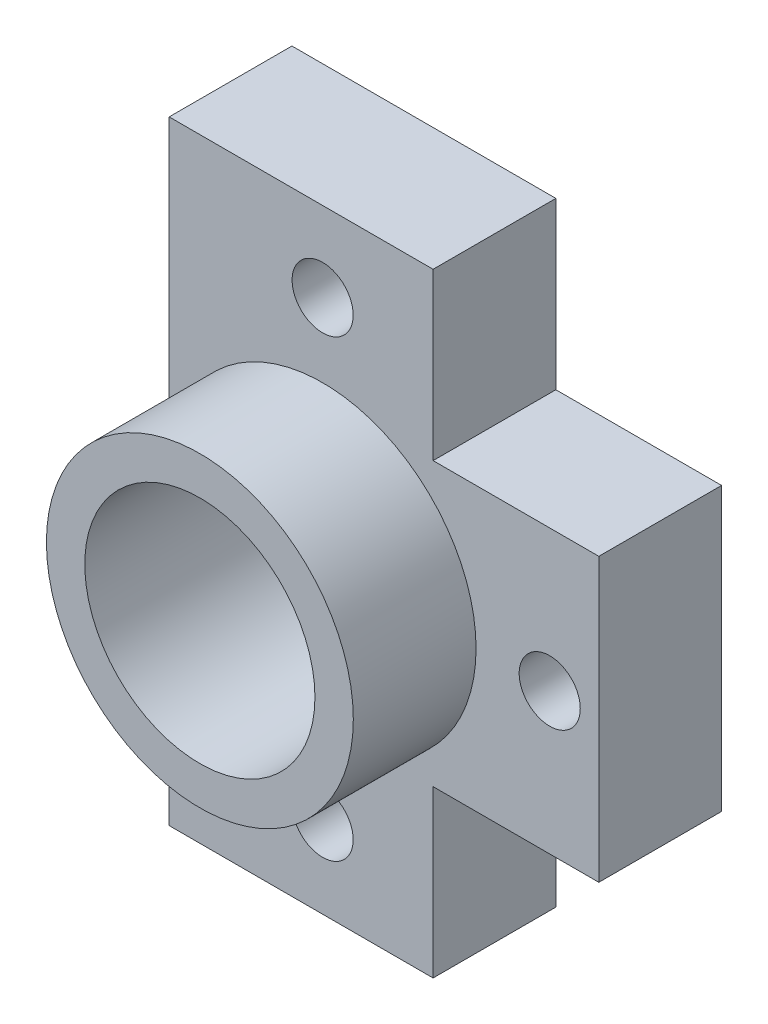
ISO-10303-21;
HEADER;
FILE_DESCRIPTION(('STEP AP214'),'2;1');
FILE_NAME('part.step','',(''),(''),'','','');
FILE_SCHEMA(('AUTOMOTIVE_DESIGN { 1 0 10303 214 1 1 1 1 }'));
ENDSEC;
DATA;
#1=APPLICATION_CONTEXT('core data for automotive mechanical design processes');
#2=APPLICATION_PROTOCOL_DEFINITION('international standard','automotive_design',2000,#1);
#3=PRODUCT_CONTEXT('',#1,'mechanical');
#4=PRODUCT('Part','Part','',(#3));
#5=PRODUCT_RELATED_PRODUCT_CATEGORY('part','',(#4));
#6=PRODUCT_DEFINITION_FORMATION('','',#4);
#7=PRODUCT_DEFINITION_CONTEXT('part definition',#1,'design');
#8=PRODUCT_DEFINITION('design','',#6,#7);
#9=PRODUCT_DEFINITION_SHAPE('','',#8);
#10=(LENGTH_UNIT() NAMED_UNIT(*) SI_UNIT(.MILLI.,.METRE.));
#11=(NAMED_UNIT(*) PLANE_ANGLE_UNIT() SI_UNIT($,.RADIAN.));
#12=(NAMED_UNIT(*) SI_UNIT($,.STERADIAN.) SOLID_ANGLE_UNIT());
#13=UNCERTAINTY_MEASURE_WITH_UNIT(LENGTH_MEASURE(1.E-05),#10,'distance_accuracy_value','');
#14=(GEOMETRIC_REPRESENTATION_CONTEXT(3) GLOBAL_UNCERTAINTY_ASSIGNED_CONTEXT((#13)) GLOBAL_UNIT_ASSIGNED_CONTEXT((#10,
#11,#12)) REPRESENTATION_CONTEXT('',''));
#15=CARTESIAN_POINT('',(0.,0.,0.));
#16=DIRECTION('',(0.,0.,1.));
#17=DIRECTION('',(1.,0.,0.));
#18=AXIS2_PLACEMENT_3D('',#15,#16,#17);
#19=CARTESIAN_POINT('',(8.89,-12.7,10.16));
#20=DIRECTION('',(-1.,0.,0.));
#21=DIRECTION('',(0.,0.,1.));
#22=AXIS2_PLACEMENT_3D('',#19,#20,#21);
#23=PLANE('',#22);
#24=DIRECTION('',(0.,1.,0.));
#25=VECTOR('',#24,1.);
#26=CARTESIAN_POINT('',(8.89,-12.7,5.08));
#27=LINE('',#26,#25);
#28=CARTESIAN_POINT('',(8.89,-5.842,5.08));
#29=VERTEX_POINT('',#28);
#30=CARTESIAN_POINT('',(8.89,5.842,5.08));
#31=VERTEX_POINT('',#30);
#32=EDGE_CURVE('E120',#29,#31,#27,.T.);
#33=ORIENTED_EDGE('',*,*,#32,.F.);
#34=DIRECTION('',(0.,0.,1.));
#35=VECTOR('',#34,1.);
#36=CARTESIAN_POINT('',(8.89,-5.842,0.));
#37=LINE('',#36,#35);
#38=CARTESIAN_POINT('',(8.89,-5.842,0.));
#39=VERTEX_POINT('',#38);
#40=EDGE_CURVE('E52',#39,#29,#37,.T.);
#41=ORIENTED_EDGE('',*,*,#40,.F.);
#42=DIRECTION('',(0.,1.,0.));
#43=VECTOR('',#42,1.);
#44=CARTESIAN_POINT('',(8.89,-12.7,0.));
#45=LINE('',#44,#43);
#46=CARTESIAN_POINT('',(8.89,5.842,0.));
#47=VERTEX_POINT('',#46);
#48=EDGE_CURVE('E118',#39,#47,#45,.T.);
#49=ORIENTED_EDGE('',*,*,#48,.T.);
#50=DIRECTION('',(0.,0.,1.));
#51=VECTOR('',#50,1.);
#52=CARTESIAN_POINT('',(8.89,5.842,0.));
#53=LINE('',#52,#51);
#54=EDGE_CURVE('E227',#47,#31,#53,.T.);
#55=ORIENTED_EDGE('',*,*,#54,.T.);
#56=EDGE_LOOP('',(#33,#41,#49,#55));
#57=FACE_BOUND('',#56,.T.);
#58=ADVANCED_FACE('F36',(#57),#23,.F.);
#59=CARTESIAN_POINT('',(-8.89,12.7,10.16));
#60=DIRECTION('',(0.,-1.,0.));
#61=DIRECTION('',(0.,0.,-1.));
#62=AXIS2_PLACEMENT_3D('',#59,#60,#61);
#63=PLANE('',#62);
#64=DIRECTION('',(-1.,0.,0.));
#65=VECTOR('',#64,1.);
#66=CARTESIAN_POINT('',(-8.89,12.7,5.08));
#67=LINE('',#66,#65);
#68=CARTESIAN_POINT('',(2.032,12.7,5.08));
#69=VERTEX_POINT('',#68);
#70=CARTESIAN_POINT('',(-8.89,12.7,5.08));
#71=VERTEX_POINT('',#70);
#72=EDGE_CURVE('E175',#69,#71,#67,.T.);
#73=ORIENTED_EDGE('',*,*,#72,.F.);
#74=DIRECTION('',(0.,0.,1.));
#75=VECTOR('',#74,1.);
#76=CARTESIAN_POINT('',(2.032,12.7,0.));
#77=LINE('',#76,#75);
#78=CARTESIAN_POINT('',(2.032,12.7,0.));
#79=VERTEX_POINT('',#78);
#80=EDGE_CURVE('E60',#79,#69,#77,.T.);
#81=ORIENTED_EDGE('',*,*,#80,.F.);
#82=DIRECTION('',(-1.,0.,0.));
#83=VECTOR('',#82,1.);
#84=CARTESIAN_POINT('',(-8.89,12.7,0.));
#85=LINE('',#84,#83);
#86=CARTESIAN_POINT('',(-8.89,12.7,0.));
#87=VERTEX_POINT('',#86);
#88=EDGE_CURVE('E128',#79,#87,#85,.T.);
#89=ORIENTED_EDGE('',*,*,#88,.T.);
#90=DIRECTION('',(0.,0.,-1.));
#91=VECTOR('',#90,1.);
#92=CARTESIAN_POINT('',(-8.89,12.7,10.16));
#93=LINE('',#92,#91);
#94=EDGE_CURVE('E44',#71,#87,#93,.T.);
#95=ORIENTED_EDGE('',*,*,#94,.F.);
#96=EDGE_LOOP('',(#73,#81,#89,#95));
#97=FACE_BOUND('',#96,.T.);
#98=ADVANCED_FACE('F236',(#97),#63,.F.);
#99=CARTESIAN_POINT('',(-8.89,-12.7,10.16));
#100=DIRECTION('',(1.,0.,0.));
#101=DIRECTION('',(0.,0.,-1.));
#102=AXIS2_PLACEMENT_3D('',#99,#100,#101);
#103=PLANE('',#102);
#104=DIRECTION('',(0.,-1.,0.));
#105=VECTOR('',#104,1.);
#106=CARTESIAN_POINT('',(-8.89,-12.7,5.08));
#107=LINE('',#106,#105);
#108=CARTESIAN_POINT('',(-8.88999999999999,0.,5.08));
#109=VERTEX_POINT('',#108);
#110=EDGE_CURVE('E174',#71,#109,#107,.T.);
#111=ORIENTED_EDGE('',*,*,#110,.F.);
#112=ORIENTED_EDGE('',*,*,#94,.T.);
#113=DIRECTION('',(0.,-1.,0.));
#114=VECTOR('',#113,1.);
#115=CARTESIAN_POINT('',(-8.89,-12.7,0.));
#116=LINE('',#115,#114);
#117=CARTESIAN_POINT('',(-8.89,-12.7,0.));
#118=VERTEX_POINT('',#117);
#119=EDGE_CURVE('E131',#87,#118,#116,.T.);
#120=ORIENTED_EDGE('',*,*,#119,.T.);
#121=DIRECTION('',(0.,0.,-1.));
#122=VECTOR('',#121,1.);
#123=CARTESIAN_POINT('',(-8.89,-12.7,10.16));
#124=LINE('',#123,#122);
#125=CARTESIAN_POINT('',(-8.89,-12.7,5.08));
#126=VERTEX_POINT('',#125);
#127=EDGE_CURVE('E143',#126,#118,#124,.T.);
#128=ORIENTED_EDGE('',*,*,#127,.F.);
#129=EDGE_CURVE('E170',#109,#126,#107,.T.);
#130=ORIENTED_EDGE('',*,*,#129,.F.);
#131=EDGE_LOOP('',(#111,#112,#120,#128,#130));
#132=FACE_BOUND('',#131,.T.);
#133=ADVANCED_FACE('F204',(#132),#103,.F.);
#134=CARTESIAN_POINT('',(-8.89,-12.7,10.16));
#135=DIRECTION('',(0.,1.,0.));
#136=DIRECTION('',(0.,0.,1.));
#137=AXIS2_PLACEMENT_3D('',#134,#135,#136);
#138=PLANE('',#137);
#139=DIRECTION('',(1.,0.,0.));
#140=VECTOR('',#139,1.);
#141=CARTESIAN_POINT('',(-8.89,-12.7,0.));
#142=LINE('',#141,#140);
#143=CARTESIAN_POINT('',(2.032,-12.7,0.));
#144=VERTEX_POINT('',#143);
#145=EDGE_CURVE('E140',#118,#144,#142,.T.);
#146=ORIENTED_EDGE('',*,*,#145,.T.);
#147=DIRECTION('',(0.,0.,1.));
#148=VECTOR('',#147,1.);
#149=CARTESIAN_POINT('',(2.032,-12.7,0.));
#150=LINE('',#149,#148);
#151=CARTESIAN_POINT('',(2.032,-12.7,5.08));
#152=VERTEX_POINT('',#151);
#153=EDGE_CURVE('E210',#144,#152,#150,.T.);
#154=ORIENTED_EDGE('',*,*,#153,.T.);
#155=DIRECTION('',(1.,0.,0.));
#156=VECTOR('',#155,1.);
#157=CARTESIAN_POINT('',(-8.89,-12.7,5.08));
#158=LINE('',#157,#156);
#159=EDGE_CURVE('E12',#126,#152,#158,.T.);
#160=ORIENTED_EDGE('',*,*,#159,.F.);
#161=ORIENTED_EDGE('',*,*,#127,.T.);
#162=EDGE_LOOP('',(#146,#154,#160,#161));
#163=FACE_BOUND('',#162,.T.);
#164=ADVANCED_FACE('F185',(#163),#138,.F.);
#165=CARTESIAN_POINT('',(8.89,12.7,10.16));
#166=DIRECTION('',(0.,0.,-1.));
#167=DIRECTION('',(-1.,0.,0.));
#168=AXIS2_PLACEMENT_3D('',#165,#166,#167);
#169=PLANE('',#168);
#170=CARTESIAN_POINT('',(-2.53999999999999,0.,10.16));
#171=DIRECTION('',(0.,0.,1.));
#172=DIRECTION('',(1.,0.,0.));
#173=AXIS2_PLACEMENT_3D('',#170,#171,#172);
#174=CIRCLE('',#173,4.7625);
#175=CARTESIAN_POINT('',(2.22250000000001,0.,10.16));
#176=VERTEX_POINT('',#175);
#177=EDGE_CURVE('E134',#176,#176,#174,.T.);
#178=ORIENTED_EDGE('',*,*,#177,.F.);
#179=EDGE_LOOP('',(#178));
#180=FACE_BOUND('',#179,.T.);
#181=CARTESIAN_POINT('',(-2.53999999999999,0.,10.16));
#182=DIRECTION('',(0.,0.,1.));
#183=DIRECTION('',(1.,0.,0.));
#184=AXIS2_PLACEMENT_3D('',#181,#182,#183);
#185=CIRCLE('',#184,6.35);
#186=CARTESIAN_POINT('',(3.81000000000001,0.,10.16));
#187=VERTEX_POINT('',#186);
#188=EDGE_CURVE('E166',#187,#187,#185,.T.);
#189=ORIENTED_EDGE('',*,*,#188,.T.);
#190=EDGE_LOOP('',(#189));
#191=FACE_BOUND('',#190,.T.);
#192=ADVANCED_FACE('F182',(#180,#191),#169,.F.);
#193=CARTESIAN_POINT('',(8.89,12.7,0.));
#194=DIRECTION('',(0.,0.,-1.));
#195=DIRECTION('',(-1.,0.,0.));
#196=AXIS2_PLACEMENT_3D('',#193,#194,#195);
#197=PLANE('',#196);
#198=DIRECTION('',(0.,-1.,0.));
#199=VECTOR('',#198,1.);
#200=CARTESIAN_POINT('',(2.032,-12.7,0.));
#201=LINE('',#200,#199);
#202=CARTESIAN_POINT('',(2.032,-5.842,0.));
#203=VERTEX_POINT('',#202);
#204=EDGE_CURVE('E112',#203,#144,#201,.T.);
#205=ORIENTED_EDGE('',*,*,#204,.T.);
#206=ORIENTED_EDGE('',*,*,#145,.F.);
#207=ORIENTED_EDGE('',*,*,#119,.F.);
#208=ORIENTED_EDGE('',*,*,#88,.F.);
#209=DIRECTION('',(0.,-1.,0.));
#210=VECTOR('',#209,1.);
#211=CARTESIAN_POINT('',(2.032,12.7,0.));
#212=LINE('',#211,#210);
#213=CARTESIAN_POINT('',(2.032,5.842,0.));
#214=VERTEX_POINT('',#213);
#215=EDGE_CURVE('E220',#79,#214,#212,.T.);
#216=ORIENTED_EDGE('',*,*,#215,.T.);
#217=DIRECTION('',(1.,0.,0.));
#218=VECTOR('',#217,1.);
#219=CARTESIAN_POINT('',(8.89,5.842,0.));
#220=LINE('',#219,#218);
#221=EDGE_CURVE('E127',#214,#47,#220,.T.);
#222=ORIENTED_EDGE('',*,*,#221,.T.);
#223=ORIENTED_EDGE('',*,*,#48,.F.);
#224=DIRECTION('',(-1.,0.,0.));
#225=VECTOR('',#224,1.);
#226=CARTESIAN_POINT('',(8.89,-5.842,0.));
#227=LINE('',#226,#225);
#228=EDGE_CURVE('E105',#39,#203,#227,.T.);
#229=ORIENTED_EDGE('',*,*,#228,.T.);
#230=EDGE_LOOP('',(#205,#206,#207,#208,#216,#222,#223,#229));
#231=FACE_BOUND('',#230,.T.);
#232=CARTESIAN_POINT('',(6.85800000000001,0.,0.));
#233=DIRECTION('',(0.,0.,1.));
#234=DIRECTION('',(1.,0.,0.));
#235=AXIS2_PLACEMENT_3D('',#232,#233,#234);
#236=CIRCLE('',#235,1.26365);
#237=CARTESIAN_POINT('',(8.12165000000001,0.,0.));
#238=VERTEX_POINT('',#237);
#239=EDGE_CURVE('E160',#238,#238,#236,.T.);
#240=ORIENTED_EDGE('',*,*,#239,.T.);
#241=EDGE_LOOP('',(#240));
#242=FACE_BOUND('',#241,.T.);
#243=CARTESIAN_POINT('',(-2.53999999999999,-9.398,0.));
#244=DIRECTION('',(0.,0.,1.));
#245=DIRECTION('',(1.,0.,0.));
#246=AXIS2_PLACEMENT_3D('',#243,#244,#245);
#247=CIRCLE('',#246,1.26365);
#248=CARTESIAN_POINT('',(-1.27634999999999,-9.398,0.));
#249=VERTEX_POINT('',#248);
#250=EDGE_CURVE('E149',#249,#249,#247,.T.);
#251=ORIENTED_EDGE('',*,*,#250,.T.);
#252=EDGE_LOOP('',(#251));
#253=FACE_BOUND('',#252,.T.);
#254=CARTESIAN_POINT('',(-2.53999999999999,9.398,0.));
#255=DIRECTION('',(0.,0.,1.));
#256=DIRECTION('',(1.,0.,0.));
#257=AXIS2_PLACEMENT_3D('',#254,#255,#256);
#258=CIRCLE('',#257,1.26365);
#259=CARTESIAN_POINT('',(-1.27634999999999,9.398,0.));
#260=VERTEX_POINT('',#259);
#261=EDGE_CURVE('E148',#260,#260,#258,.T.);
#262=ORIENTED_EDGE('',*,*,#261,.T.);
#263=EDGE_LOOP('',(#262));
#264=FACE_BOUND('',#263,.T.);
#265=CARTESIAN_POINT('',(-2.53999999999999,0.,0.));
#266=DIRECTION('',(0.,0.,-1.));
#267=DIRECTION('',(-1.,0.,0.));
#268=AXIS2_PLACEMENT_3D('',#265,#266,#267);
#269=CIRCLE('',#268,4.7625);
#270=CARTESIAN_POINT('',(-7.30249999999999,0.,0.));
#271=VERTEX_POINT('',#270);
#272=EDGE_CURVE('E129',#271,#271,#269,.T.);
#273=ORIENTED_EDGE('',*,*,#272,.F.);
#274=EDGE_LOOP('',(#273));
#275=FACE_BOUND('',#274,.T.);
#276=ADVANCED_FACE('F123',(#231,#242,#253,#264,#275),#197,.T.);
#277=CARTESIAN_POINT('',(-2.53999999999999,0.,10.16));
#278=DIRECTION('',(0.,0.,1.));
#279=DIRECTION('',(1.,0.,0.));
#280=AXIS2_PLACEMENT_3D('',#277,#278,#279);
#281=CYLINDRICAL_SURFACE('',#280,4.7625);
#282=ORIENTED_EDGE('',*,*,#272,.T.);
#283=EDGE_LOOP('',(#282));
#284=FACE_BOUND('',#283,.T.);
#285=ORIENTED_EDGE('',*,*,#177,.T.);
#286=EDGE_LOOP('',(#285));
#287=FACE_BOUND('',#286,.T.);
#288=ADVANCED_FACE('F180',(#284,#287),#281,.F.);
#289=CARTESIAN_POINT('',(0.,0.,5.08));
#290=DIRECTION('',(0.,0.,1.));
#291=DIRECTION('',(1.,0.,0.));
#292=AXIS2_PLACEMENT_3D('',#289,#290,#291);
#293=PLANE('',#292);
#294=DIRECTION('',(0.,-1.,0.));
#295=VECTOR('',#294,1.);
#296=CARTESIAN_POINT('',(2.032,-12.7,5.08));
#297=LINE('',#296,#295);
#298=CARTESIAN_POINT('',(2.032,-5.842,5.08));
#299=VERTEX_POINT('',#298);
#300=EDGE_CURVE('E113',#299,#152,#297,.T.);
#301=ORIENTED_EDGE('',*,*,#300,.F.);
#302=DIRECTION('',(-1.,0.,0.));
#303=VECTOR('',#302,1.);
#304=CARTESIAN_POINT('',(8.89,-5.842,5.08));
#305=LINE('',#304,#303);
#306=EDGE_CURVE('E211',#29,#299,#305,.T.);
#307=ORIENTED_EDGE('',*,*,#306,.F.);
#308=ORIENTED_EDGE('',*,*,#32,.T.);
#309=DIRECTION('',(1.,0.,0.));
#310=VECTOR('',#309,1.);
#311=CARTESIAN_POINT('',(8.89,5.842,5.08));
#312=LINE('',#311,#310);
#313=CARTESIAN_POINT('',(2.032,5.842,5.08));
#314=VERTEX_POINT('',#313);
#315=EDGE_CURVE('E222',#314,#31,#312,.T.);
#316=ORIENTED_EDGE('',*,*,#315,.F.);
#317=DIRECTION('',(0.,-1.,0.));
#318=VECTOR('',#317,1.);
#319=CARTESIAN_POINT('',(2.032,12.7,5.08));
#320=LINE('',#319,#318);
#321=EDGE_CURVE('E218',#69,#314,#320,.T.);
#322=ORIENTED_EDGE('',*,*,#321,.F.);
#323=ORIENTED_EDGE('',*,*,#72,.T.);
#324=ORIENTED_EDGE('',*,*,#110,.T.);
#325=CARTESIAN_POINT('',(-2.53999999999999,0.,5.08));
#326=DIRECTION('',(0.,0.,1.));
#327=DIRECTION('',(1.,0.,0.));
#328=AXIS2_PLACEMENT_3D('',#325,#326,#327);
#329=CIRCLE('',#328,6.35);
#330=EDGE_CURVE('E167',#109,#109,#329,.T.);
#331=ORIENTED_EDGE('',*,*,#330,.F.);
#332=ORIENTED_EDGE('',*,*,#129,.T.);
#333=ORIENTED_EDGE('',*,*,#159,.T.);
#334=EDGE_LOOP('',(#301,#307,#308,#316,#322,#323,#324,#331,#332,#333));
#335=FACE_BOUND('',#334,.T.);
#336=CARTESIAN_POINT('',(6.85800000000001,0.,5.08));
#337=DIRECTION('',(0.,0.,1.));
#338=DIRECTION('',(1.,0.,0.));
#339=AXIS2_PLACEMENT_3D('',#336,#337,#338);
#340=CIRCLE('',#339,1.26364999999999);
#341=CARTESIAN_POINT('',(8.12165,0.,5.08));
#342=VERTEX_POINT('',#341);
#343=EDGE_CURVE('E39',#342,#342,#340,.T.);
#344=ORIENTED_EDGE('',*,*,#343,.F.);
#345=EDGE_LOOP('',(#344));
#346=FACE_BOUND('',#345,.T.);
#347=CARTESIAN_POINT('',(-2.53999999999999,-9.398,5.08));
#348=DIRECTION('',(0.,0.,1.));
#349=DIRECTION('',(1.,0.,0.));
#350=AXIS2_PLACEMENT_3D('',#347,#348,#349);
#351=CIRCLE('',#350,1.26364999999999);
#352=CARTESIAN_POINT('',(-1.27635,-9.398,5.08));
#353=VERTEX_POINT('',#352);
#354=EDGE_CURVE('E146',#353,#353,#351,.T.);
#355=ORIENTED_EDGE('',*,*,#354,.F.);
#356=EDGE_LOOP('',(#355));
#357=FACE_BOUND('',#356,.T.);
#358=CARTESIAN_POINT('',(-2.53999999999999,9.398,5.08));
#359=DIRECTION('',(0.,0.,1.));
#360=DIRECTION('',(1.,0.,0.));
#361=AXIS2_PLACEMENT_3D('',#358,#359,#360);
#362=CIRCLE('',#361,1.26364999999999);
#363=CARTESIAN_POINT('',(-1.27635,9.398,5.08));
#364=VERTEX_POINT('',#363);
#365=EDGE_CURVE('E153',#364,#364,#362,.T.);
#366=ORIENTED_EDGE('',*,*,#365,.F.);
#367=EDGE_LOOP('',(#366));
#368=FACE_BOUND('',#367,.T.);
#369=ADVANCED_FACE('F193',(#335,#346,#357,#368),#293,.T.);
#370=CARTESIAN_POINT('',(-2.53999999999999,0.,5.08));
#371=DIRECTION('',(0.,0.,1.));
#372=DIRECTION('',(1.,0.,0.));
#373=AXIS2_PLACEMENT_3D('',#370,#371,#372);
#374=CYLINDRICAL_SURFACE('',#373,6.35);
#375=ORIENTED_EDGE('',*,*,#188,.F.);
#376=EDGE_LOOP('',(#375));
#377=FACE_BOUND('',#376,.T.);
#378=ORIENTED_EDGE('',*,*,#330,.T.);
#379=EDGE_LOOP('',(#378));
#380=FACE_BOUND('',#379,.T.);
#381=ADVANCED_FACE('F189',(#377,#380),#374,.T.);
#382=CARTESIAN_POINT('',(-2.53999999999999,9.398,10.16));
#383=DIRECTION('',(0.,0.,1.));
#384=DIRECTION('',(1.,0.,0.));
#385=AXIS2_PLACEMENT_3D('',#382,#383,#384);
#386=CYLINDRICAL_SURFACE('',#385,1.26364999999999);
#387=ORIENTED_EDGE('',*,*,#365,.T.);
#388=EDGE_LOOP('',(#387));
#389=FACE_BOUND('',#388,.T.);
#390=ORIENTED_EDGE('',*,*,#261,.F.);
#391=EDGE_LOOP('',(#390));
#392=FACE_BOUND('',#391,.T.);
#393=ADVANCED_FACE('F192',(#389,#392),#386,.F.);
#394=CARTESIAN_POINT('',(-2.53999999999999,-9.398,10.16));
#395=DIRECTION('',(0.,0.,1.));
#396=DIRECTION('',(1.,0.,0.));
#397=AXIS2_PLACEMENT_3D('',#394,#395,#396);
#398=CYLINDRICAL_SURFACE('',#397,1.26364999999999);
#399=ORIENTED_EDGE('',*,*,#354,.T.);
#400=EDGE_LOOP('',(#399));
#401=FACE_BOUND('',#400,.T.);
#402=ORIENTED_EDGE('',*,*,#250,.F.);
#403=EDGE_LOOP('',(#402));
#404=FACE_BOUND('',#403,.T.);
#405=ADVANCED_FACE('F267',(#401,#404),#398,.F.);
#406=CARTESIAN_POINT('',(6.85800000000001,0.,10.16));
#407=DIRECTION('',(0.,0.,1.));
#408=DIRECTION('',(1.,0.,0.));
#409=AXIS2_PLACEMENT_3D('',#406,#407,#408);
#410=CYLINDRICAL_SURFACE('',#409,1.26364999999999);
#411=ORIENTED_EDGE('',*,*,#343,.T.);
#412=EDGE_LOOP('',(#411));
#413=FACE_BOUND('',#412,.T.);
#414=ORIENTED_EDGE('',*,*,#239,.F.);
#415=EDGE_LOOP('',(#414));
#416=FACE_BOUND('',#415,.T.);
#417=ADVANCED_FACE('F271',(#413,#416),#410,.F.);
#418=CARTESIAN_POINT('',(8.89,5.842,0.));
#419=DIRECTION('',(0.,-1.,0.));
#420=DIRECTION('',(1.,0.,0.));
#421=AXIS2_PLACEMENT_3D('',#418,#419,#420);
#422=PLANE('',#421);
#423=ORIENTED_EDGE('',*,*,#315,.T.);
#424=ORIENTED_EDGE('',*,*,#54,.F.);
#425=ORIENTED_EDGE('',*,*,#221,.F.);
#426=DIRECTION('',(0.,0.,1.));
#427=VECTOR('',#426,1.);
#428=CARTESIAN_POINT('',(2.032,5.842,0.));
#429=LINE('',#428,#427);
#430=EDGE_CURVE('E229',#214,#314,#429,.T.);
#431=ORIENTED_EDGE('',*,*,#430,.T.);
#432=EDGE_LOOP('',(#423,#424,#425,#431));
#433=FACE_BOUND('',#432,.T.);
#434=ADVANCED_FACE('F231',(#433),#422,.F.);
#435=CARTESIAN_POINT('',(2.032,12.7,0.));
#436=DIRECTION('',(-1.,0.,0.));
#437=DIRECTION('',(0.,-1.,0.));
#438=AXIS2_PLACEMENT_3D('',#435,#436,#437);
#439=PLANE('',#438);
#440=ORIENTED_EDGE('',*,*,#321,.T.);
#441=ORIENTED_EDGE('',*,*,#430,.F.);
#442=ORIENTED_EDGE('',*,*,#215,.F.);
#443=ORIENTED_EDGE('',*,*,#80,.T.);
#444=EDGE_LOOP('',(#440,#441,#442,#443));
#445=FACE_BOUND('',#444,.T.);
#446=ADVANCED_FACE('F233',(#445),#439,.F.);
#447=CARTESIAN_POINT('',(2.032,-12.7,0.));
#448=DIRECTION('',(-1.,0.,0.));
#449=DIRECTION('',(0.,0.,1.));
#450=AXIS2_PLACEMENT_3D('',#447,#448,#449);
#451=PLANE('',#450);
#452=ORIENTED_EDGE('',*,*,#300,.T.);
#453=ORIENTED_EDGE('',*,*,#153,.F.);
#454=ORIENTED_EDGE('',*,*,#204,.F.);
#455=DIRECTION('',(0.,0.,1.));
#456=VECTOR('',#455,1.);
#457=CARTESIAN_POINT('',(2.032,-5.842,0.));
#458=LINE('',#457,#456);
#459=EDGE_CURVE('E107',#203,#299,#458,.T.);
#460=ORIENTED_EDGE('',*,*,#459,.T.);
#461=EDGE_LOOP('',(#452,#453,#454,#460));
#462=FACE_BOUND('',#461,.T.);
#463=ADVANCED_FACE('F238',(#462),#451,.F.);
#464=CARTESIAN_POINT('',(8.89,-5.842,0.));
#465=DIRECTION('',(0.,1.,0.));
#466=DIRECTION('',(-1.,0.,0.));
#467=AXIS2_PLACEMENT_3D('',#464,#465,#466);
#468=PLANE('',#467);
#469=ORIENTED_EDGE('',*,*,#306,.T.);
#470=ORIENTED_EDGE('',*,*,#459,.F.);
#471=ORIENTED_EDGE('',*,*,#228,.F.);
#472=ORIENTED_EDGE('',*,*,#40,.T.);
#473=EDGE_LOOP('',(#469,#470,#471,#472));
#474=FACE_BOUND('',#473,.T.);
#475=ADVANCED_FACE('F106',(#474),#468,.F.);
#476=CLOSED_SHELL('',(#58,#98,#133,#164,#192,#276,#288,#369,#381,#393,#405,#417,#434,#446,#463,#475));
#477=MANIFOLD_SOLID_BREP('B2',#476);
#478=ADVANCED_BREP_SHAPE_REPRESENTATION('',(#18,#477),#14);
#479=SHAPE_DEFINITION_REPRESENTATION(#9,#478);
ENDSEC;
END-ISO-10303-21;
